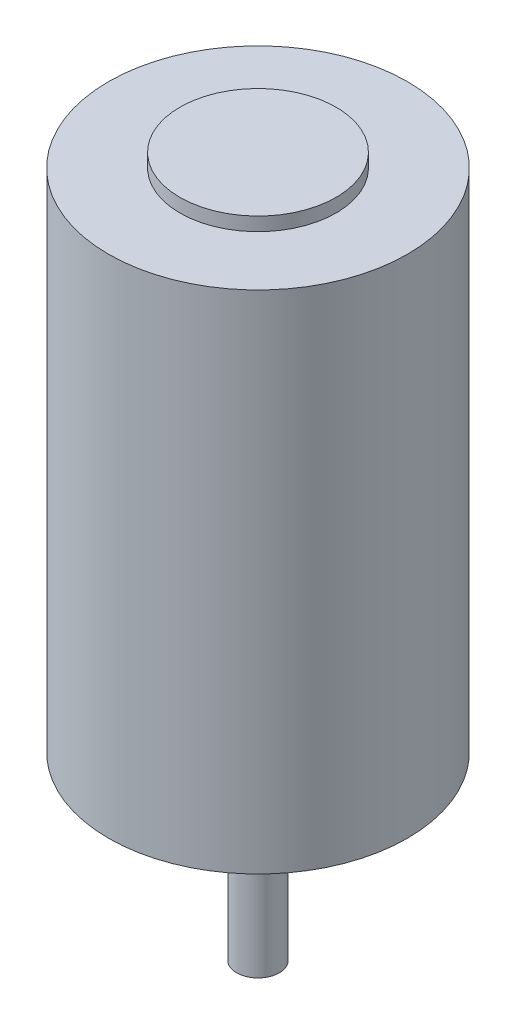
ISO-10303-21;
HEADER;
FILE_DESCRIPTION(('STEP AP214'),'2;1');
FILE_NAME('part.step','',(''),(''),'','','');
FILE_SCHEMA(('AUTOMOTIVE_DESIGN { 1 0 10303 214 1 1 1 1 }'));
ENDSEC;
DATA;
#1=APPLICATION_CONTEXT('core data for automotive mechanical design processes');
#2=APPLICATION_PROTOCOL_DEFINITION('international standard','automotive_design',2000,#1);
#3=PRODUCT_CONTEXT('',#1,'mechanical');
#4=PRODUCT('Part','Part','',(#3));
#5=PRODUCT_RELATED_PRODUCT_CATEGORY('part','',(#4));
#6=PRODUCT_DEFINITION_FORMATION('','',#4);
#7=PRODUCT_DEFINITION_CONTEXT('part definition',#1,'design');
#8=PRODUCT_DEFINITION('design','',#6,#7);
#9=PRODUCT_DEFINITION_SHAPE('','',#8);
#10=(LENGTH_UNIT() NAMED_UNIT(*) SI_UNIT(.MILLI.,.METRE.));
#11=(NAMED_UNIT(*) PLANE_ANGLE_UNIT() SI_UNIT($,.RADIAN.));
#12=(NAMED_UNIT(*) SI_UNIT($,.STERADIAN.) SOLID_ANGLE_UNIT());
#13=UNCERTAINTY_MEASURE_WITH_UNIT(LENGTH_MEASURE(1.E-05),#10,'distance_accuracy_value','');
#14=(GEOMETRIC_REPRESENTATION_CONTEXT(3) GLOBAL_UNCERTAINTY_ASSIGNED_CONTEXT((#13)) GLOBAL_UNIT_ASSIGNED_CONTEXT((#10,
#11,#12)) REPRESENTATION_CONTEXT('',''));
#15=CARTESIAN_POINT('',(0.,0.,0.));
#16=DIRECTION('',(0.,0.,1.));
#17=DIRECTION('',(1.,0.,0.));
#18=AXIS2_PLACEMENT_3D('',#15,#16,#17);
#19=CARTESIAN_POINT('',(0.,71.12,0.));
#20=DIRECTION('',(0.,-1.,0.));
#21=DIRECTION('',(0.,0.,-1.));
#22=AXIS2_PLACEMENT_3D('',#19,#20,#21);
#23=CYLINDRICAL_SURFACE('',#22,21.0185);
#24=CARTESIAN_POINT('',(0.,71.12,0.));
#25=DIRECTION('',(0.,1.,0.));
#26=DIRECTION('',(0.,0.,1.));
#27=AXIS2_PLACEMENT_3D('',#24,#25,#26);
#28=CIRCLE('',#27,21.0185);
#29=CARTESIAN_POINT('',(0.,71.12,21.0185));
#30=VERTEX_POINT('',#29);
#31=EDGE_CURVE('E56',#30,#30,#28,.T.);
#32=ORIENTED_EDGE('',*,*,#31,.F.);
#33=EDGE_LOOP('',(#32));
#34=FACE_BOUND('',#33,.T.);
#35=CARTESIAN_POINT('',(0.,0.,0.));
#36=DIRECTION('',(0.,1.,0.));
#37=DIRECTION('',(0.,0.,1.));
#38=AXIS2_PLACEMENT_3D('',#35,#36,#37);
#39=CIRCLE('',#38,21.0185);
#40=CARTESIAN_POINT('',(0.,0.,21.0185));
#41=VERTEX_POINT('',#40);
#42=EDGE_CURVE('E59',#41,#41,#39,.T.);
#43=ORIENTED_EDGE('',*,*,#42,.T.);
#44=EDGE_LOOP('',(#43));
#45=FACE_BOUND('',#44,.T.);
#46=ADVANCED_FACE('F41',(#34,#45),#23,.T.);
#47=CARTESIAN_POINT('',(0.,71.12,0.));
#48=DIRECTION('',(0.,1.,0.));
#49=DIRECTION('',(0.,0.,1.));
#50=AXIS2_PLACEMENT_3D('',#47,#48,#49);
#51=PLANE('',#50);
#52=CARTESIAN_POINT('',(0.,71.12,0.));
#53=DIRECTION('',(0.,1.,0.));
#54=DIRECTION('',(0.,0.,1.));
#55=AXIS2_PLACEMENT_3D('',#52,#53,#54);
#56=CIRCLE('',#55,10.9855);
#57=CARTESIAN_POINT('',(0.,71.12,10.9855));
#58=VERTEX_POINT('',#57);
#59=EDGE_CURVE('E51',#58,#58,#56,.T.);
#60=ORIENTED_EDGE('',*,*,#59,.F.);
#61=EDGE_LOOP('',(#60));
#62=FACE_BOUND('',#61,.T.);
#63=ORIENTED_EDGE('',*,*,#31,.T.);
#64=EDGE_LOOP('',(#63));
#65=FACE_BOUND('',#64,.T.);
#66=ADVANCED_FACE('F102',(#62,#65),#51,.T.);
#67=CARTESIAN_POINT('',(0.,0.,0.));
#68=DIRECTION('',(0.,1.,0.));
#69=DIRECTION('',(0.,0.,1.));
#70=AXIS2_PLACEMENT_3D('',#67,#68,#69);
#71=PLANE('',#70);
#72=CARTESIAN_POINT('',(15.875,0.,0.));
#73=DIRECTION('',(0.,-1.,0.));
#74=DIRECTION('',(0.,0.,-1.));
#75=AXIS2_PLACEMENT_3D('',#72,#73,#74);
#76=CIRCLE('',#75,1.27);
#77=CARTESIAN_POINT('',(15.875,0.,-1.27));
#78=VERTEX_POINT('',#77);
#79=EDGE_CURVE('E76',#78,#78,#76,.T.);
#80=ORIENTED_EDGE('',*,*,#79,.F.);
#81=EDGE_LOOP('',(#80));
#82=FACE_BOUND('',#81,.T.);
#83=CARTESIAN_POINT('',(-15.875,0.,0.));
#84=DIRECTION('',(0.,-1.,0.));
#85=DIRECTION('',(0.,0.,1.));
#86=AXIS2_PLACEMENT_3D('',#83,#84,#85);
#87=CIRCLE('',#86,1.27);
#88=CARTESIAN_POINT('',(-15.875,0.,1.27));
#89=VERTEX_POINT('',#88);
#90=EDGE_CURVE('E257',#89,#89,#87,.T.);
#91=ORIENTED_EDGE('',*,*,#90,.F.);
#92=EDGE_LOOP('',(#91));
#93=FACE_BOUND('',#92,.T.);
#94=CARTESIAN_POINT('',(0.,0.,0.));
#95=DIRECTION('',(0.,1.,0.));
#96=DIRECTION('',(0.,0.,1.));
#97=AXIS2_PLACEMENT_3D('',#94,#95,#96);
#98=CIRCLE('',#97,10.9855);
#99=CARTESIAN_POINT('',(0.,0.,10.9855));
#100=VERTEX_POINT('',#99);
#101=EDGE_CURVE('E47',#100,#100,#98,.F.);
#102=ORIENTED_EDGE('',*,*,#101,.F.);
#103=EDGE_LOOP('',(#102));
#104=FACE_BOUND('',#103,.T.);
#105=ORIENTED_EDGE('',*,*,#42,.F.);
#106=EDGE_LOOP('',(#105));
#107=FACE_BOUND('',#106,.T.);
#108=ADVANCED_FACE('F99',(#82,#93,#104,#107),#71,.F.);
#109=CARTESIAN_POINT('',(0.,73.025,0.));
#110=DIRECTION('',(0.,-1.,0.));
#111=DIRECTION('',(0.,0.,-1.));
#112=AXIS2_PLACEMENT_3D('',#109,#110,#111);
#113=CYLINDRICAL_SURFACE('',#112,10.9855);
#114=CARTESIAN_POINT('',(0.,73.025,0.));
#115=DIRECTION('',(0.,1.,0.));
#116=DIRECTION('',(0.,0.,1.));
#117=AXIS2_PLACEMENT_3D('',#114,#115,#116);
#118=CIRCLE('',#117,10.9855);
#119=CARTESIAN_POINT('',(0.,73.025,10.9855));
#120=VERTEX_POINT('',#119);
#121=EDGE_CURVE('E90',#120,#120,#118,.T.);
#122=ORIENTED_EDGE('',*,*,#121,.F.);
#123=EDGE_LOOP('',(#122));
#124=FACE_BOUND('',#123,.T.);
#125=ORIENTED_EDGE('',*,*,#59,.T.);
#126=EDGE_LOOP('',(#125));
#127=FACE_BOUND('',#126,.T.);
#128=ADVANCED_FACE('F101',(#124,#127),#113,.T.);
#129=CARTESIAN_POINT('',(0.,73.025,0.));
#130=DIRECTION('',(0.,1.,0.));
#131=DIRECTION('',(0.,0.,1.));
#132=AXIS2_PLACEMENT_3D('',#129,#130,#131);
#133=PLANE('',#132);
#134=ORIENTED_EDGE('',*,*,#121,.T.);
#135=EDGE_LOOP('',(#134));
#136=FACE_BOUND('',#135,.T.);
#137=ADVANCED_FACE('F110',(#136),#133,.T.);
#138=CARTESIAN_POINT('',(0.,-1.905,0.));
#139=DIRECTION('',(0.,-1.,0.));
#140=DIRECTION('',(0.,0.,-1.));
#141=AXIS2_PLACEMENT_3D('',#138,#139,#140);
#142=PLANE('',#141);
#143=CARTESIAN_POINT('',(0.,-1.905,0.));
#144=DIRECTION('',(0.,-1.,0.));
#145=DIRECTION('',(0.,0.,-1.));
#146=AXIS2_PLACEMENT_3D('',#143,#144,#145);
#147=CIRCLE('',#146,10.9855);
#148=CARTESIAN_POINT('',(0.,-1.905,-10.9855));
#149=VERTEX_POINT('',#148);
#150=EDGE_CURVE('E85',#149,#149,#147,.T.);
#151=ORIENTED_EDGE('',*,*,#150,.T.);
#152=EDGE_LOOP('',(#151));
#153=FACE_BOUND('',#152,.T.);
#154=CARTESIAN_POINT('',(0.,-1.905,0.));
#155=DIRECTION('',(0.,-1.,0.));
#156=DIRECTION('',(0.,0.,-1.));
#157=AXIS2_PLACEMENT_3D('',#154,#155,#156);
#158=CIRCLE('',#157,8.4455);
#159=CARTESIAN_POINT('',(0.,-1.905,-8.4455));
#160=VERTEX_POINT('',#159);
#161=EDGE_CURVE('E82',#160,#160,#158,.T.);
#162=ORIENTED_EDGE('',*,*,#161,.F.);
#163=EDGE_LOOP('',(#162));
#164=FACE_BOUND('',#163,.T.);
#165=ADVANCED_FACE('F143',(#153,#164),#142,.T.);
#166=CARTESIAN_POINT('',(0.,-1.905,0.));
#167=DIRECTION('',(0.,1.,0.));
#168=DIRECTION('',(0.,0.,1.));
#169=AXIS2_PLACEMENT_3D('',#166,#167,#168);
#170=CYLINDRICAL_SURFACE('',#169,10.9855);
#171=ORIENTED_EDGE('',*,*,#150,.F.);
#172=EDGE_LOOP('',(#171));
#173=FACE_BOUND('',#172,.T.);
#174=ORIENTED_EDGE('',*,*,#101,.T.);
#175=EDGE_LOOP('',(#174));
#176=FACE_BOUND('',#175,.T.);
#177=ADVANCED_FACE('F153',(#173,#176),#170,.T.);
#178=CARTESIAN_POINT('',(0.,-1.905,0.));
#179=DIRECTION('',(0.,1.,0.));
#180=DIRECTION('',(0.,0.,1.));
#181=AXIS2_PLACEMENT_3D('',#178,#179,#180);
#182=CYLINDRICAL_SURFACE('',#181,8.4455);
#183=ORIENTED_EDGE('',*,*,#161,.T.);
#184=EDGE_LOOP('',(#183));
#185=FACE_BOUND('',#184,.T.);
#186=CARTESIAN_POINT('',(0.,0.,0.));
#187=DIRECTION('',(0.,-1.,0.));
#188=DIRECTION('',(0.,0.,-1.));
#189=AXIS2_PLACEMENT_3D('',#186,#187,#188);
#190=CIRCLE('',#189,8.4455);
#191=CARTESIAN_POINT('',(0.,0.,-8.4455));
#192=VERTEX_POINT('',#191);
#193=EDGE_CURVE('E68',#192,#192,#190,.T.);
#194=ORIENTED_EDGE('',*,*,#193,.F.);
#195=EDGE_LOOP('',(#194));
#196=FACE_BOUND('',#195,.T.);
#197=ADVANCED_FACE('F120',(#185,#196),#182,.F.);
#198=CARTESIAN_POINT('',(0.,0.,0.));
#199=DIRECTION('',(0.,1.,0.));
#200=DIRECTION('',(0.,0.,1.));
#201=AXIS2_PLACEMENT_3D('',#198,#199,#200);
#202=CIRCLE('',#201,5.08);
#203=CARTESIAN_POINT('',(0.,0.,5.08));
#204=VERTEX_POINT('',#203);
#205=EDGE_CURVE('E10',#204,#204,#202,.F.);
#206=ORIENTED_EDGE('',*,*,#205,.F.);
#207=EDGE_LOOP('',(#206));
#208=FACE_BOUND('',#207,.T.);
#209=ORIENTED_EDGE('',*,*,#193,.T.);
#210=EDGE_LOOP('',(#209));
#211=FACE_BOUND('',#210,.T.);
#212=ADVANCED_FACE('F104',(#208,#211),#71,.F.);
#213=CARTESIAN_POINT('',(0.,-3.429,0.));
#214=DIRECTION('',(0.,1.,0.));
#215=DIRECTION('',(0.,0.,1.));
#216=AXIS2_PLACEMENT_3D('',#213,#214,#215);
#217=CYLINDRICAL_SURFACE('',#216,5.08);
#218=CARTESIAN_POINT('',(0.,-3.429,0.));
#219=DIRECTION('',(0.,-1.,0.));
#220=DIRECTION('',(0.,0.,-1.));
#221=AXIS2_PLACEMENT_3D('',#218,#219,#220);
#222=CIRCLE('',#221,5.08);
#223=CARTESIAN_POINT('',(0.,-3.429,-5.08));
#224=VERTEX_POINT('',#223);
#225=EDGE_CURVE('E64',#224,#224,#222,.T.);
#226=ORIENTED_EDGE('',*,*,#225,.F.);
#227=EDGE_LOOP('',(#226));
#228=FACE_BOUND('',#227,.T.);
#229=ORIENTED_EDGE('',*,*,#205,.T.);
#230=EDGE_LOOP('',(#229));
#231=FACE_BOUND('',#230,.T.);
#232=ADVANCED_FACE('F119',(#228,#231),#217,.T.);
#233=CARTESIAN_POINT('',(0.,-3.429,0.));
#234=DIRECTION('',(0.,-1.,0.));
#235=DIRECTION('',(0.,0.,-1.));
#236=AXIS2_PLACEMENT_3D('',#233,#234,#235);
#237=PLANE('',#236);
#238=CARTESIAN_POINT('',(0.,-3.429,0.));
#239=DIRECTION('',(0.,-1.,0.));
#240=DIRECTION('',(0.,0.,-1.));
#241=AXIS2_PLACEMENT_3D('',#238,#239,#240);
#242=CIRCLE('',#241,3.);
#243=CARTESIAN_POINT('',(0.,-3.429,-3.));
#244=VERTEX_POINT('',#243);
#245=EDGE_CURVE('E61',#244,#244,#242,.T.);
#246=ORIENTED_EDGE('',*,*,#245,.F.);
#247=EDGE_LOOP('',(#246));
#248=FACE_BOUND('',#247,.T.);
#249=ORIENTED_EDGE('',*,*,#225,.T.);
#250=EDGE_LOOP('',(#249));
#251=FACE_BOUND('',#250,.T.);
#252=ADVANCED_FACE('F180',(#248,#251),#237,.T.);
#253=CARTESIAN_POINT('',(0.,-25.4,0.));
#254=DIRECTION('',(0.,-1.,0.));
#255=DIRECTION('',(0.,0.,-1.));
#256=AXIS2_PLACEMENT_3D('',#253,#254,#255);
#257=PLANE('',#256);
#258=CARTESIAN_POINT('',(0.,-25.4,0.));
#259=DIRECTION('',(0.,-1.,0.));
#260=DIRECTION('',(0.,0.,-1.));
#261=AXIS2_PLACEMENT_3D('',#258,#259,#260);
#262=CIRCLE('',#261,3.);
#263=CARTESIAN_POINT('',(0.,-25.4,-3.));
#264=VERTEX_POINT('',#263);
#265=EDGE_CURVE('E63',#264,#264,#262,.T.);
#266=ORIENTED_EDGE('',*,*,#265,.T.);
#267=EDGE_LOOP('',(#266));
#268=FACE_BOUND('',#267,.T.);
#269=ADVANCED_FACE('F176',(#268),#257,.T.);
#270=CARTESIAN_POINT('',(0.,-25.4,0.));
#271=DIRECTION('',(0.,1.,0.));
#272=DIRECTION('',(0.,0.,1.));
#273=AXIS2_PLACEMENT_3D('',#270,#271,#272);
#274=CYLINDRICAL_SURFACE('',#273,3.);
#275=ORIENTED_EDGE('',*,*,#245,.T.);
#276=EDGE_LOOP('',(#275));
#277=FACE_BOUND('',#276,.T.);
#278=ORIENTED_EDGE('',*,*,#265,.F.);
#279=EDGE_LOOP('',(#278));
#280=FACE_BOUND('',#279,.T.);
#281=ADVANCED_FACE('F179',(#277,#280),#274,.T.);
#282=CARTESIAN_POINT('',(-15.875,5.08,0.));
#283=DIRECTION('',(0.,-1.,0.));
#284=DIRECTION('',(0.,0.,-1.));
#285=AXIS2_PLACEMENT_3D('',#282,#283,#284);
#286=CYLINDRICAL_SURFACE('',#285,1.27);
#287=CARTESIAN_POINT('',(-15.875,5.08,0.));
#288=DIRECTION('',(0.,-1.,0.));
#289=DIRECTION('',(0.,0.,1.));
#290=AXIS2_PLACEMENT_3D('',#287,#288,#289);
#291=CIRCLE('',#290,1.27);
#292=CARTESIAN_POINT('',(-15.875,5.08,1.27));
#293=VERTEX_POINT('',#292);
#294=EDGE_CURVE('E79',#293,#293,#291,.T.);
#295=ORIENTED_EDGE('',*,*,#294,.F.);
#296=EDGE_LOOP('',(#295));
#297=FACE_BOUND('',#296,.T.);
#298=ORIENTED_EDGE('',*,*,#90,.T.);
#299=EDGE_LOOP('',(#298));
#300=FACE_BOUND('',#299,.T.);
#301=ADVANCED_FACE('F207',(#297,#300),#286,.F.);
#302=CARTESIAN_POINT('',(-15.875,5.08,0.));
#303=DIRECTION('',(0.,1.,0.));
#304=DIRECTION('',(0.,0.,1.));
#305=AXIS2_PLACEMENT_3D('',#302,#303,#304);
#306=PLANE('',#305);
#307=ORIENTED_EDGE('',*,*,#294,.T.);
#308=EDGE_LOOP('',(#307));
#309=FACE_BOUND('',#308,.T.);
#310=ADVANCED_FACE('F220',(#309),#306,.F.);
#311=CARTESIAN_POINT('',(15.875,5.08,0.));
#312=DIRECTION('',(0.,-1.,0.));
#313=DIRECTION('',(0.,0.,-1.));
#314=AXIS2_PLACEMENT_3D('',#311,#312,#313);
#315=CYLINDRICAL_SURFACE('',#314,1.27);
#316=CARTESIAN_POINT('',(15.875,5.08,0.));
#317=DIRECTION('',(0.,-1.,0.));
#318=DIRECTION('',(0.,0.,-1.));
#319=AXIS2_PLACEMENT_3D('',#316,#317,#318);
#320=CIRCLE('',#319,1.27);
#321=CARTESIAN_POINT('',(15.875,5.08,-1.27));
#322=VERTEX_POINT('',#321);
#323=EDGE_CURVE('E71',#322,#322,#320,.T.);
#324=ORIENTED_EDGE('',*,*,#323,.F.);
#325=EDGE_LOOP('',(#324));
#326=FACE_BOUND('',#325,.T.);
#327=ORIENTED_EDGE('',*,*,#79,.T.);
#328=EDGE_LOOP('',(#327));
#329=FACE_BOUND('',#328,.T.);
#330=ADVANCED_FACE('F229',(#326,#329),#315,.F.);
#331=CARTESIAN_POINT('',(15.875,5.08,0.));
#332=DIRECTION('',(0.,-1.,0.));
#333=DIRECTION('',(0.,0.,-1.));
#334=AXIS2_PLACEMENT_3D('',#331,#332,#333);
#335=PLANE('',#334);
#336=ORIENTED_EDGE('',*,*,#323,.T.);
#337=EDGE_LOOP('',(#336));
#338=FACE_BOUND('',#337,.T.);
#339=ADVANCED_FACE('F238',(#338),#335,.T.);
#340=CLOSED_SHELL('',(#46,#66,#108,#128,#137,#165,#177,#197,#212,#232,#252,#269,#281,#301,#310,
#330,#339));
#341=MANIFOLD_SOLID_BREP('B2',#340);
#342=ADVANCED_BREP_SHAPE_REPRESENTATION('',(#18,#341),#14);
#343=SHAPE_DEFINITION_REPRESENTATION(#9,#342);
ENDSEC;
END-ISO-10303-21;
